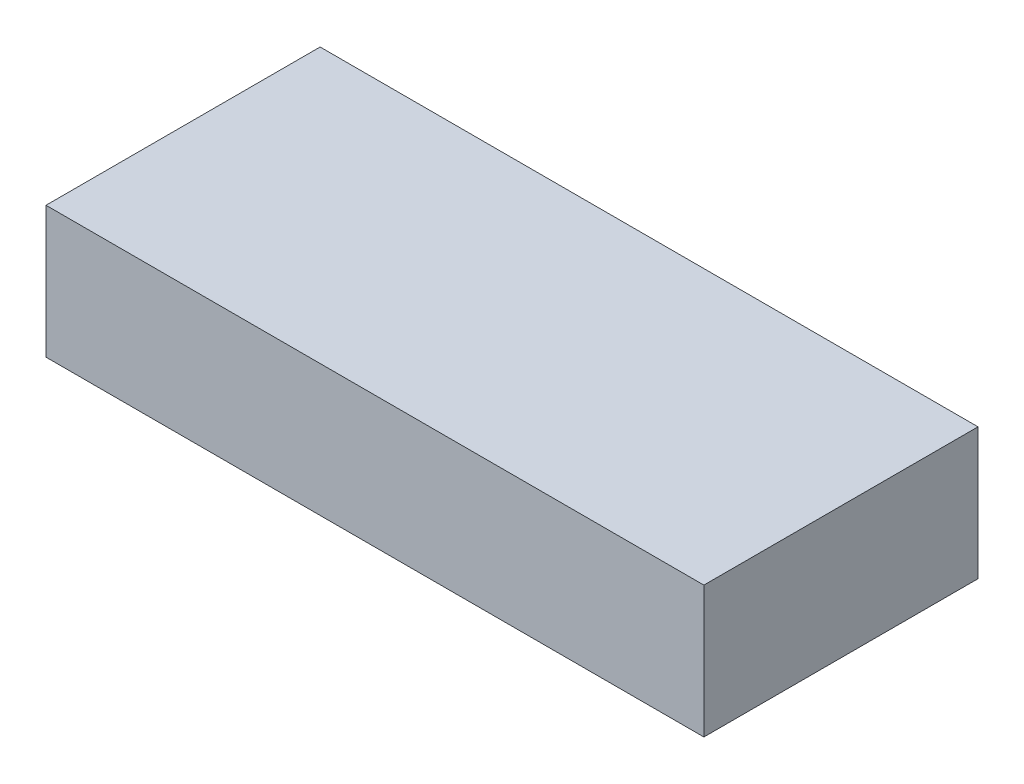
ISO-10303-21;
HEADER;
FILE_DESCRIPTION(('STEP AP214'),'2;1');
FILE_NAME('part.step','',(''),(''),'','','');
FILE_SCHEMA(('AUTOMOTIVE_DESIGN { 1 0 10303 214 1 1 1 1 }'));
ENDSEC;
DATA;
#1=APPLICATION_CONTEXT('core data for automotive mechanical design processes');
#2=APPLICATION_PROTOCOL_DEFINITION('international standard','automotive_design',2000,#1);
#3=PRODUCT_CONTEXT('',#1,'mechanical');
#4=PRODUCT('Part','Part','',(#3));
#5=PRODUCT_RELATED_PRODUCT_CATEGORY('part','',(#4));
#6=PRODUCT_DEFINITION_FORMATION('','',#4);
#7=PRODUCT_DEFINITION_CONTEXT('part definition',#1,'design');
#8=PRODUCT_DEFINITION('design','',#6,#7);
#9=PRODUCT_DEFINITION_SHAPE('','',#8);
#10=(LENGTH_UNIT() NAMED_UNIT(*) SI_UNIT(.MILLI.,.METRE.));
#11=(NAMED_UNIT(*) PLANE_ANGLE_UNIT() SI_UNIT($,.RADIAN.));
#12=(NAMED_UNIT(*) SI_UNIT($,.STERADIAN.) SOLID_ANGLE_UNIT());
#13=UNCERTAINTY_MEASURE_WITH_UNIT(LENGTH_MEASURE(1.E-05),#10,'distance_accuracy_value','');
#14=(GEOMETRIC_REPRESENTATION_CONTEXT(3) GLOBAL_UNCERTAINTY_ASSIGNED_CONTEXT((#13)) GLOBAL_UNIT_ASSIGNED_CONTEXT((#10,
#11,#12)) REPRESENTATION_CONTEXT('',''));
#15=CARTESIAN_POINT('',(0.,0.,0.));
#16=DIRECTION('',(0.,0.,1.));
#17=DIRECTION('',(1.,0.,0.));
#18=AXIS2_PLACEMENT_3D('',#15,#16,#17);
#19=CARTESIAN_POINT('',(240.,48.,200.));
#20=DIRECTION('',(-1.,0.,0.));
#21=DIRECTION('',(0.,0.,1.));
#22=AXIS2_PLACEMENT_3D('',#19,#20,#21);
#23=PLANE('',#22);
#24=DIRECTION('',(0.,1.,0.));
#25=VECTOR('',#24,1.);
#26=CARTESIAN_POINT('',(240.,48.,0.));
#27=LINE('',#26,#25);
#28=CARTESIAN_POINT('',(240.,-48.,0.));
#29=VERTEX_POINT('',#28);
#30=CARTESIAN_POINT('',(240.,48.,0.));
#31=VERTEX_POINT('',#30);
#32=EDGE_CURVE('E98',#29,#31,#27,.T.);
#33=ORIENTED_EDGE('',*,*,#32,.T.);
#34=DIRECTION('',(0.,0.,-1.));
#35=VECTOR('',#34,1.);
#36=CARTESIAN_POINT('',(240.,48.,200.));
#37=LINE('',#36,#35);
#38=CARTESIAN_POINT('',(240.,48.,200.));
#39=VERTEX_POINT('',#38);
#40=EDGE_CURVE('E11',#39,#31,#37,.T.);
#41=ORIENTED_EDGE('',*,*,#40,.F.);
#42=DIRECTION('',(0.,1.,0.));
#43=VECTOR('',#42,1.);
#44=CARTESIAN_POINT('',(240.,48.,200.));
#45=LINE('',#44,#43);
#46=CARTESIAN_POINT('',(240.,-48.,200.));
#47=VERTEX_POINT('',#46);
#48=EDGE_CURVE('E86',#47,#39,#45,.T.);
#49=ORIENTED_EDGE('',*,*,#48,.F.);
#50=DIRECTION('',(0.,0.,-1.));
#51=VECTOR('',#50,1.);
#52=CARTESIAN_POINT('',(240.,-48.,200.));
#53=LINE('',#52,#51);
#54=EDGE_CURVE('E94',#47,#29,#53,.T.);
#55=ORIENTED_EDGE('',*,*,#54,.T.);
#56=EDGE_LOOP('',(#33,#41,#49,#55));
#57=FACE_BOUND('',#56,.T.);
#58=ADVANCED_FACE('F35',(#57),#23,.F.);
#59=CARTESIAN_POINT('',(-240.,48.,200.));
#60=DIRECTION('',(0.,-1.,0.));
#61=DIRECTION('',(0.,0.,-1.));
#62=AXIS2_PLACEMENT_3D('',#59,#60,#61);
#63=PLANE('',#62);
#64=DIRECTION('',(-1.,0.,0.));
#65=VECTOR('',#64,1.);
#66=CARTESIAN_POINT('',(-240.,48.,0.));
#67=LINE('',#66,#65);
#68=CARTESIAN_POINT('',(-240.,48.,0.));
#69=VERTEX_POINT('',#68);
#70=EDGE_CURVE('E90',#31,#69,#67,.T.);
#71=ORIENTED_EDGE('',*,*,#70,.T.);
#72=DIRECTION('',(0.,0.,-1.));
#73=VECTOR('',#72,1.);
#74=CARTESIAN_POINT('',(-240.,48.,200.));
#75=LINE('',#74,#73);
#76=CARTESIAN_POINT('',(-240.,48.,200.));
#77=VERTEX_POINT('',#76);
#78=EDGE_CURVE('E43',#77,#69,#75,.T.);
#79=ORIENTED_EDGE('',*,*,#78,.F.);
#80=DIRECTION('',(-1.,0.,0.));
#81=VECTOR('',#80,1.);
#82=CARTESIAN_POINT('',(-240.,48.,200.));
#83=LINE('',#82,#81);
#84=EDGE_CURVE('E81',#39,#77,#83,.T.);
#85=ORIENTED_EDGE('',*,*,#84,.F.);
#86=ORIENTED_EDGE('',*,*,#40,.T.);
#87=EDGE_LOOP('',(#71,#79,#85,#86));
#88=FACE_BOUND('',#87,.T.);
#89=ADVANCED_FACE('F89',(#88),#63,.F.);
#90=CARTESIAN_POINT('',(-240.,48.,200.));
#91=DIRECTION('',(1.,0.,0.));
#92=DIRECTION('',(0.,0.,-1.));
#93=AXIS2_PLACEMENT_3D('',#90,#91,#92);
#94=PLANE('',#93);
#95=DIRECTION('',(0.,-1.,0.));
#96=VECTOR('',#95,1.);
#97=CARTESIAN_POINT('',(-240.,48.,0.));
#98=LINE('',#97,#96);
#99=CARTESIAN_POINT('',(-240.,-48.,0.));
#100=VERTEX_POINT('',#99);
#101=EDGE_CURVE('E68',#69,#100,#98,.T.);
#102=ORIENTED_EDGE('',*,*,#101,.T.);
#103=DIRECTION('',(0.,0.,-1.));
#104=VECTOR('',#103,1.);
#105=CARTESIAN_POINT('',(-240.,-48.,200.));
#106=LINE('',#105,#104);
#107=CARTESIAN_POINT('',(-240.,-48.,200.));
#108=VERTEX_POINT('',#107);
#109=EDGE_CURVE('E91',#108,#100,#106,.T.);
#110=ORIENTED_EDGE('',*,*,#109,.F.);
#111=DIRECTION('',(0.,-1.,0.));
#112=VECTOR('',#111,1.);
#113=CARTESIAN_POINT('',(-240.,48.,200.));
#114=LINE('',#113,#112);
#115=EDGE_CURVE('E84',#77,#108,#114,.T.);
#116=ORIENTED_EDGE('',*,*,#115,.F.);
#117=ORIENTED_EDGE('',*,*,#78,.T.);
#118=EDGE_LOOP('',(#102,#110,#116,#117));
#119=FACE_BOUND('',#118,.T.);
#120=ADVANCED_FACE('F92',(#119),#94,.F.);
#121=CARTESIAN_POINT('',(-240.,-48.,200.));
#122=DIRECTION('',(0.,1.,0.));
#123=DIRECTION('',(0.,0.,1.));
#124=AXIS2_PLACEMENT_3D('',#121,#122,#123);
#125=PLANE('',#124);
#126=DIRECTION('',(1.,0.,0.));
#127=VECTOR('',#126,1.);
#128=CARTESIAN_POINT('',(-240.,-48.,0.));
#129=LINE('',#128,#127);
#130=EDGE_CURVE('E74',#100,#29,#129,.T.);
#131=ORIENTED_EDGE('',*,*,#130,.T.);
#132=ORIENTED_EDGE('',*,*,#54,.F.);
#133=DIRECTION('',(1.,0.,0.));
#134=VECTOR('',#133,1.);
#135=CARTESIAN_POINT('',(-240.,-48.,200.));
#136=LINE('',#135,#134);
#137=EDGE_CURVE('E51',#108,#47,#136,.T.);
#138=ORIENTED_EDGE('',*,*,#137,.F.);
#139=ORIENTED_EDGE('',*,*,#109,.T.);
#140=EDGE_LOOP('',(#131,#132,#138,#139));
#141=FACE_BOUND('',#140,.T.);
#142=ADVANCED_FACE('F105',(#141),#125,.F.);
#143=CARTESIAN_POINT('',(0.,0.,200.));
#144=DIRECTION('',(0.,0.,1.));
#145=DIRECTION('',(1.,0.,0.));
#146=AXIS2_PLACEMENT_3D('',#143,#144,#145);
#147=PLANE('',#146);
#148=ORIENTED_EDGE('',*,*,#48,.T.);
#149=ORIENTED_EDGE('',*,*,#84,.T.);
#150=ORIENTED_EDGE('',*,*,#115,.T.);
#151=ORIENTED_EDGE('',*,*,#137,.T.);
#152=EDGE_LOOP('',(#148,#149,#150,#151));
#153=FACE_BOUND('',#152,.T.);
#154=ADVANCED_FACE('F82',(#153),#147,.T.);
#155=CARTESIAN_POINT('',(0.,0.,0.));
#156=DIRECTION('',(0.,0.,1.));
#157=DIRECTION('',(1.,0.,0.));
#158=AXIS2_PLACEMENT_3D('',#155,#156,#157);
#159=PLANE('',#158);
#160=ORIENTED_EDGE('',*,*,#32,.F.);
#161=ORIENTED_EDGE('',*,*,#130,.F.);
#162=ORIENTED_EDGE('',*,*,#101,.F.);
#163=ORIENTED_EDGE('',*,*,#70,.F.);
#164=EDGE_LOOP('',(#160,#161,#162,#163));
#165=FACE_BOUND('',#164,.T.);
#166=ADVANCED_FACE('F108',(#165),#159,.F.);
#167=CLOSED_SHELL('',(#58,#89,#120,#142,#154,#166));
#168=MANIFOLD_SOLID_BREP('B2',#167);
#169=ADVANCED_BREP_SHAPE_REPRESENTATION('',(#18,#168),#14);
#170=SHAPE_DEFINITION_REPRESENTATION(#9,#169);
ENDSEC;
END-ISO-10303-21;
